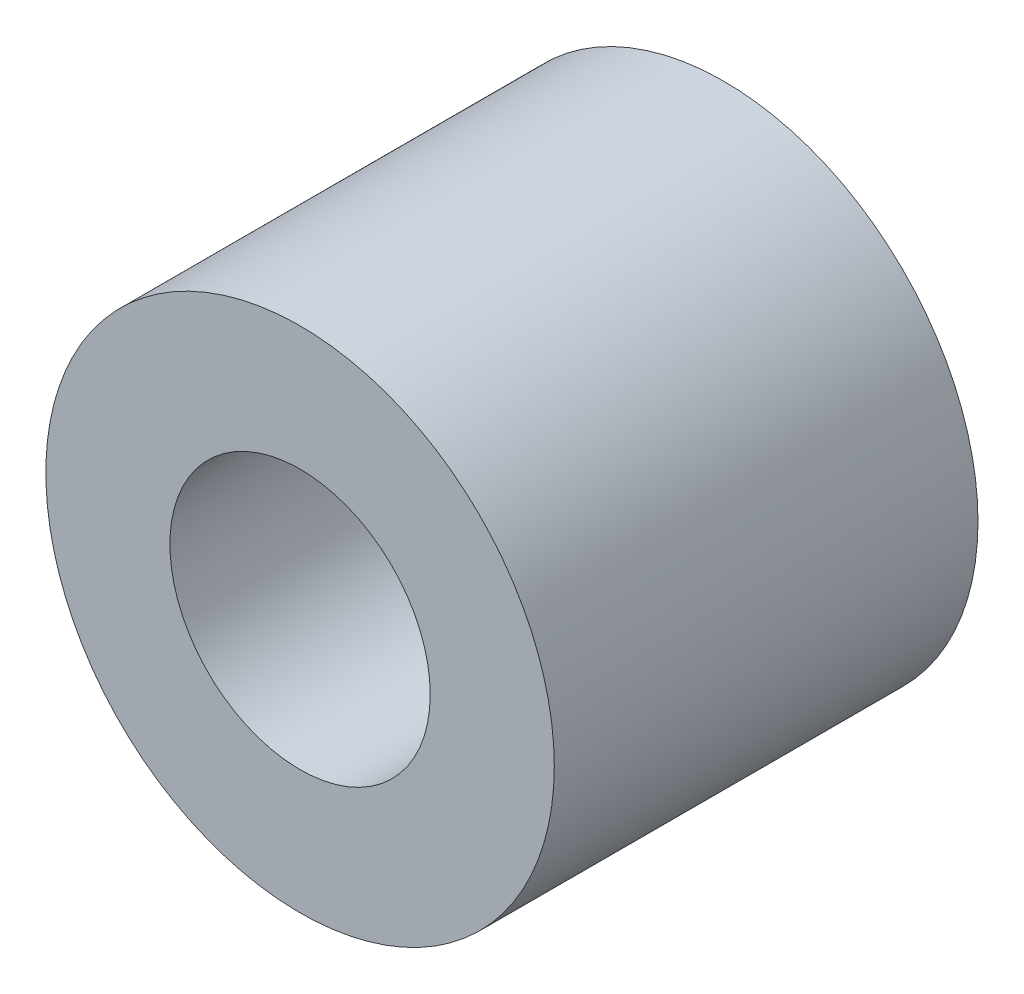
ISO-10303-21;
HEADER;
FILE_DESCRIPTION(('STEP AP214'),'2;1');
FILE_NAME('part.step','',(''),(''),'','','');
FILE_SCHEMA(('AUTOMOTIVE_DESIGN { 1 0 10303 214 1 1 1 1 }'));
ENDSEC;
DATA;
#1=APPLICATION_CONTEXT('core data for automotive mechanical design processes');
#2=APPLICATION_PROTOCOL_DEFINITION('international standard','automotive_design',2000,#1);
#3=PRODUCT_CONTEXT('',#1,'mechanical');
#4=PRODUCT('Part','Part','',(#3));
#5=PRODUCT_RELATED_PRODUCT_CATEGORY('part','',(#4));
#6=PRODUCT_DEFINITION_FORMATION('','',#4);
#7=PRODUCT_DEFINITION_CONTEXT('part definition',#1,'design');
#8=PRODUCT_DEFINITION('design','',#6,#7);
#9=PRODUCT_DEFINITION_SHAPE('','',#8);
#10=(LENGTH_UNIT() NAMED_UNIT(*) SI_UNIT(.MILLI.,.METRE.));
#11=(NAMED_UNIT(*) PLANE_ANGLE_UNIT() SI_UNIT($,.RADIAN.));
#12=(NAMED_UNIT(*) SI_UNIT($,.STERADIAN.) SOLID_ANGLE_UNIT());
#13=UNCERTAINTY_MEASURE_WITH_UNIT(LENGTH_MEASURE(1.E-05),#10,'distance_accuracy_value','');
#14=(GEOMETRIC_REPRESENTATION_CONTEXT(3) GLOBAL_UNCERTAINTY_ASSIGNED_CONTEXT((#13)) GLOBAL_UNIT_ASSIGNED_CONTEXT((#10,
#11,#12)) REPRESENTATION_CONTEXT('',''));
#15=CARTESIAN_POINT('',(0.,0.,0.));
#16=DIRECTION('',(0.,0.,1.));
#17=DIRECTION('',(1.,0.,0.));
#18=AXIS2_PLACEMENT_3D('',#15,#16,#17);
#19=CARTESIAN_POINT('',(0.,0.,3.96875));
#20=DIRECTION('',(0.,0.,1.));
#21=DIRECTION('',(1.,0.,0.));
#22=AXIS2_PLACEMENT_3D('',#19,#20,#21);
#23=PLANE('',#22);
#24=CARTESIAN_POINT('',(0.,0.,3.96875));
#25=DIRECTION('',(0.,0.,1.));
#26=DIRECTION('',(1.,0.,0.));
#27=AXIS2_PLACEMENT_3D('',#24,#25,#26);
#28=CIRCLE('',#27,4.7625);
#29=CARTESIAN_POINT('',(4.7625,0.,3.96875));
#30=VERTEX_POINT('',#29);
#31=EDGE_CURVE('E10',#30,#30,#28,.T.);
#32=ORIENTED_EDGE('',*,*,#31,.T.);
#33=EDGE_LOOP('',(#32));
#34=FACE_BOUND('',#33,.T.);
#35=CARTESIAN_POINT('',(0.,0.,3.96875));
#36=DIRECTION('',(0.,0.,1.));
#37=DIRECTION('',(1.,0.,0.));
#38=AXIS2_PLACEMENT_3D('',#35,#36,#37);
#39=CIRCLE('',#38,2.4384);
#40=CARTESIAN_POINT('',(2.4384,0.,3.96875));
#41=VERTEX_POINT('',#40);
#42=EDGE_CURVE('E37',#41,#41,#39,.T.);
#43=ORIENTED_EDGE('',*,*,#42,.F.);
#44=EDGE_LOOP('',(#43));
#45=FACE_BOUND('',#44,.T.);
#46=ADVANCED_FACE('F30',(#34,#45),#23,.T.);
#47=CARTESIAN_POINT('',(0.,0.,3.96875));
#48=DIRECTION('',(0.,0.,-1.));
#49=DIRECTION('',(-1.,0.,0.));
#50=AXIS2_PLACEMENT_3D('',#47,#48,#49);
#51=CYLINDRICAL_SURFACE('',#50,4.7625);
#52=ORIENTED_EDGE('',*,*,#31,.F.);
#53=EDGE_LOOP('',(#52));
#54=FACE_BOUND('',#53,.T.);
#55=CARTESIAN_POINT('',(0.,0.,-3.96875));
#56=DIRECTION('',(0.,0.,1.));
#57=DIRECTION('',(1.,0.,0.));
#58=AXIS2_PLACEMENT_3D('',#55,#56,#57);
#59=CIRCLE('',#58,4.7625);
#60=CARTESIAN_POINT('',(4.7625,0.,-3.96875));
#61=VERTEX_POINT('',#60);
#62=EDGE_CURVE('E41',#61,#61,#59,.T.);
#63=ORIENTED_EDGE('',*,*,#62,.T.);
#64=EDGE_LOOP('',(#63));
#65=FACE_BOUND('',#64,.T.);
#66=ADVANCED_FACE('F32',(#54,#65),#51,.T.);
#67=CARTESIAN_POINT('',(0.,0.,3.96875));
#68=DIRECTION('',(0.,0.,-1.));
#69=DIRECTION('',(-1.,0.,0.));
#70=AXIS2_PLACEMENT_3D('',#67,#68,#69);
#71=CYLINDRICAL_SURFACE('',#70,2.4384);
#72=ORIENTED_EDGE('',*,*,#42,.T.);
#73=EDGE_LOOP('',(#72));
#74=FACE_BOUND('',#73,.T.);
#75=CARTESIAN_POINT('',(0.,0.,-3.96875));
#76=DIRECTION('',(0.,0.,1.));
#77=DIRECTION('',(1.,0.,0.));
#78=AXIS2_PLACEMENT_3D('',#75,#76,#77);
#79=CIRCLE('',#78,2.4384);
#80=CARTESIAN_POINT('',(2.4384,0.,-3.96875));
#81=VERTEX_POINT('',#80);
#82=EDGE_CURVE('E45',#81,#81,#79,.T.);
#83=ORIENTED_EDGE('',*,*,#82,.F.);
#84=EDGE_LOOP('',(#83));
#85=FACE_BOUND('',#84,.T.);
#86=ADVANCED_FACE('F54',(#74,#85),#71,.F.);
#87=CARTESIAN_POINT('',(0.,0.,-3.96875));
#88=DIRECTION('',(0.,0.,1.));
#89=DIRECTION('',(1.,0.,0.));
#90=AXIS2_PLACEMENT_3D('',#87,#88,#89);
#91=PLANE('',#90);
#92=ORIENTED_EDGE('',*,*,#82,.T.);
#93=EDGE_LOOP('',(#92));
#94=FACE_BOUND('',#93,.T.);
#95=ORIENTED_EDGE('',*,*,#62,.F.);
#96=EDGE_LOOP('',(#95));
#97=FACE_BOUND('',#96,.T.);
#98=ADVANCED_FACE('F51',(#94,#97),#91,.F.);
#99=CLOSED_SHELL('',(#46,#66,#86,#98));
#100=MANIFOLD_SOLID_BREP('B2',#99);
#101=ADVANCED_BREP_SHAPE_REPRESENTATION('',(#18,#100),#14);
#102=SHAPE_DEFINITION_REPRESENTATION(#9,#101);
ENDSEC;
END-ISO-10303-21;
